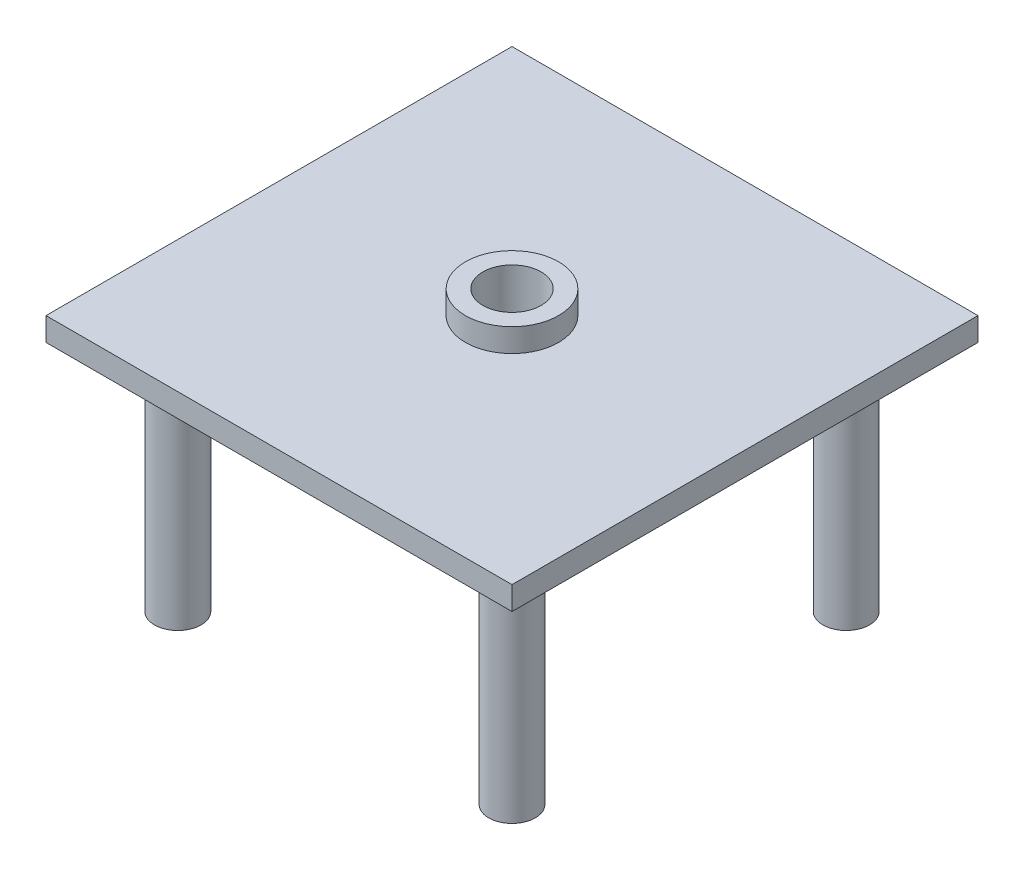
ISO-10303-21;
HEADER;
FILE_DESCRIPTION(('STEP AP214'),'2;1');
FILE_NAME('part.step','',(''),(''),'','','');
FILE_SCHEMA(('AUTOMOTIVE_DESIGN { 1 0 10303 214 1 1 1 1 }'));
ENDSEC;
DATA;
#1=APPLICATION_CONTEXT('core data for automotive mechanical design processes');
#2=APPLICATION_PROTOCOL_DEFINITION('international standard','automotive_design',2000,#1);
#3=PRODUCT_CONTEXT('',#1,'mechanical');
#4=PRODUCT('Part','Part','',(#3));
#5=PRODUCT_RELATED_PRODUCT_CATEGORY('part','',(#4));
#6=PRODUCT_DEFINITION_FORMATION('','',#4);
#7=PRODUCT_DEFINITION_CONTEXT('part definition',#1,'design');
#8=PRODUCT_DEFINITION('design','',#6,#7);
#9=PRODUCT_DEFINITION_SHAPE('','',#8);
#10=(LENGTH_UNIT() NAMED_UNIT(*) SI_UNIT(.MILLI.,.METRE.));
#11=(NAMED_UNIT(*) PLANE_ANGLE_UNIT() SI_UNIT($,.RADIAN.));
#12=(NAMED_UNIT(*) SI_UNIT($,.STERADIAN.) SOLID_ANGLE_UNIT());
#13=UNCERTAINTY_MEASURE_WITH_UNIT(LENGTH_MEASURE(1.E-05),#10,'distance_accuracy_value','');
#14=(GEOMETRIC_REPRESENTATION_CONTEXT(3) GLOBAL_UNCERTAINTY_ASSIGNED_CONTEXT((#13)) GLOBAL_UNIT_ASSIGNED_CONTEXT((#10,
#11,#12)) REPRESENTATION_CONTEXT('',''));
#15=CARTESIAN_POINT('',(0.,0.,0.));
#16=DIRECTION('',(0.,0.,1.));
#17=DIRECTION('',(1.,0.,0.));
#18=AXIS2_PLACEMENT_3D('',#15,#16,#17);
#19=CARTESIAN_POINT('',(0.,220.,0.));
#20=DIRECTION('',(0.,1.,0.));
#21=DIRECTION('',(0.,0.,1.));
#22=AXIS2_PLACEMENT_3D('',#19,#20,#21);
#23=PLANE('',#22);
#24=DIRECTION('',(0.,0.,-1.));
#25=VECTOR('',#24,1.);
#26=CARTESIAN_POINT('',(200.,220.,-200.));
#27=LINE('',#26,#25);
#28=CARTESIAN_POINT('',(200.,220.,200.));
#29=VERTEX_POINT('',#28);
#30=CARTESIAN_POINT('',(200.,220.,-200.));
#31=VERTEX_POINT('',#30);
#32=EDGE_CURVE('E86',#29,#31,#27,.T.);
#33=ORIENTED_EDGE('',*,*,#32,.T.);
#34=DIRECTION('',(-1.,0.,0.));
#35=VECTOR('',#34,1.);
#36=CARTESIAN_POINT('',(-200.,220.,-200.));
#37=LINE('',#36,#35);
#38=CARTESIAN_POINT('',(-200.,220.,-200.));
#39=VERTEX_POINT('',#38);
#40=EDGE_CURVE('E81',#31,#39,#37,.T.);
#41=ORIENTED_EDGE('',*,*,#40,.T.);
#42=DIRECTION('',(0.,0.,1.));
#43=VECTOR('',#42,1.);
#44=CARTESIAN_POINT('',(-200.,220.,-200.));
#45=LINE('',#44,#43);
#46=CARTESIAN_POINT('',(-200.,220.,200.));
#47=VERTEX_POINT('',#46);
#48=EDGE_CURVE('E84',#39,#47,#45,.T.);
#49=ORIENTED_EDGE('',*,*,#48,.T.);
#50=DIRECTION('',(1.,0.,0.));
#51=VECTOR('',#50,1.);
#52=CARTESIAN_POINT('',(-200.,220.,200.));
#53=LINE('',#52,#51);
#54=EDGE_CURVE('E50',#47,#29,#53,.T.);
#55=ORIENTED_EDGE('',*,*,#54,.T.);
#56=EDGE_LOOP('',(#33,#41,#49,#55));
#57=FACE_BOUND('',#56,.T.);
#58=CARTESIAN_POINT('',(0.,220.,0.));
#59=DIRECTION('',(0.,1.,0.));
#60=DIRECTION('',(0.,0.,1.));
#61=AXIS2_PLACEMENT_3D('',#58,#59,#60);
#62=CIRCLE('',#61,40.);
#63=CARTESIAN_POINT('',(0.,220.,40.0000000000001));
#64=VERTEX_POINT('',#63);
#65=EDGE_CURVE('E153',#64,#64,#62,.T.);
#66=ORIENTED_EDGE('',*,*,#65,.F.);
#67=EDGE_LOOP('',(#66));
#68=FACE_BOUND('',#67,.T.);
#69=ADVANCED_FACE('F33',(#57,#68),#23,.T.);
#70=CARTESIAN_POINT('',(-143.431457505076,200.,-143.431457505076));
#71=DIRECTION('',(0.,-1.,0.));
#72=DIRECTION('',(0.,0.,-1.));
#73=AXIS2_PLACEMENT_3D('',#70,#71,#72);
#74=CYLINDRICAL_SURFACE('',#73,20.);
#75=CARTESIAN_POINT('',(-143.431457505076,200.,-143.431457505076));
#76=DIRECTION('',(0.,1.,0.));
#77=DIRECTION('',(0.,0.,1.));
#78=AXIS2_PLACEMENT_3D('',#75,#76,#77);
#79=CIRCLE('',#78,20.);
#80=CARTESIAN_POINT('',(-143.431457505076,200.,-123.431457505076));
#81=VERTEX_POINT('',#80);
#82=EDGE_CURVE('E112',#81,#81,#79,.T.);
#83=ORIENTED_EDGE('',*,*,#82,.F.);
#84=EDGE_LOOP('',(#83));
#85=FACE_BOUND('',#84,.T.);
#86=CARTESIAN_POINT('',(-143.431457505076,0.,-143.431457505076));
#87=DIRECTION('',(0.,1.,0.));
#88=DIRECTION('',(0.,0.,1.));
#89=AXIS2_PLACEMENT_3D('',#86,#87,#88);
#90=CIRCLE('',#89,20.);
#91=CARTESIAN_POINT('',(-143.431457505076,0.,-123.431457505076));
#92=VERTEX_POINT('',#91);
#93=EDGE_CURVE('E111',#92,#92,#90,.T.);
#94=ORIENTED_EDGE('',*,*,#93,.T.);
#95=EDGE_LOOP('',(#94));
#96=FACE_BOUND('',#95,.T.);
#97=ADVANCED_FACE('F35',(#85,#96),#74,.T.);
#98=CARTESIAN_POINT('',(-143.431457505076,0.,-143.431457505076));
#99=DIRECTION('',(0.,1.,0.));
#100=DIRECTION('',(0.,0.,1.));
#101=AXIS2_PLACEMENT_3D('',#98,#99,#100);
#102=PLANE('',#101);
#103=ORIENTED_EDGE('',*,*,#93,.F.);
#104=EDGE_LOOP('',(#103));
#105=FACE_BOUND('',#104,.T.);
#106=ADVANCED_FACE('F129',(#105),#102,.F.);
#107=CARTESIAN_POINT('',(0.,200.,0.));
#108=DIRECTION('',(0.,1.,0.));
#109=DIRECTION('',(0.,0.,1.));
#110=AXIS2_PLACEMENT_3D('',#107,#108,#109);
#111=PLANE('',#110);
#112=CARTESIAN_POINT('',(143.431457505076,200.,-143.431457505088));
#113=DIRECTION('',(0.,1.,0.));
#114=DIRECTION('',(0.,0.,1.));
#115=AXIS2_PLACEMENT_3D('',#112,#113,#114);
#116=CIRCLE('',#115,20.);
#117=CARTESIAN_POINT('',(143.431457505076,200.,-123.431457505088));
#118=VERTEX_POINT('',#117);
#119=EDGE_CURVE('E11',#118,#118,#116,.F.);
#120=ORIENTED_EDGE('',*,*,#119,.F.);
#121=EDGE_LOOP('',(#120));
#122=FACE_BOUND('',#121,.T.);
#123=CARTESIAN_POINT('',(143.431457505088,200.,143.431457505064));
#124=DIRECTION('',(0.,1.,0.));
#125=DIRECTION('',(0.,0.,1.));
#126=AXIS2_PLACEMENT_3D('',#123,#124,#125);
#127=CIRCLE('',#126,20.);
#128=CARTESIAN_POINT('',(143.431457505088,200.,163.431457505064));
#129=VERTEX_POINT('',#128);
#130=EDGE_CURVE('E42',#129,#129,#127,.F.);
#131=ORIENTED_EDGE('',*,*,#130,.F.);
#132=EDGE_LOOP('',(#131));
#133=FACE_BOUND('',#132,.T.);
#134=CARTESIAN_POINT('',(-143.431457505064,200.,143.431457505076));
#135=DIRECTION('',(0.,1.,0.));
#136=DIRECTION('',(0.,0.,1.));
#137=AXIS2_PLACEMENT_3D('',#134,#135,#136);
#138=CIRCLE('',#137,20.);
#139=CARTESIAN_POINT('',(-143.431457505064,200.,163.431457505076));
#140=VERTEX_POINT('',#139);
#141=EDGE_CURVE('E115',#140,#140,#138,.F.);
#142=ORIENTED_EDGE('',*,*,#141,.F.);
#143=EDGE_LOOP('',(#142));
#144=FACE_BOUND('',#143,.T.);
#145=ORIENTED_EDGE('',*,*,#82,.T.);
#146=EDGE_LOOP('',(#145));
#147=FACE_BOUND('',#146,.T.);
#148=DIRECTION('',(0.,0.,-1.));
#149=VECTOR('',#148,1.);
#150=CARTESIAN_POINT('',(200.,200.,-200.));
#151=LINE('',#150,#149);
#152=CARTESIAN_POINT('',(200.,200.,200.));
#153=VERTEX_POINT('',#152);
#154=CARTESIAN_POINT('',(200.,200.,-200.));
#155=VERTEX_POINT('',#154);
#156=EDGE_CURVE('E101',#153,#155,#151,.T.);
#157=ORIENTED_EDGE('',*,*,#156,.F.);
#158=DIRECTION('',(1.,0.,0.));
#159=VECTOR('',#158,1.);
#160=CARTESIAN_POINT('',(-200.,200.,200.));
#161=LINE('',#160,#159);
#162=CARTESIAN_POINT('',(-200.,200.,200.));
#163=VERTEX_POINT('',#162);
#164=EDGE_CURVE('E73',#163,#153,#161,.T.);
#165=ORIENTED_EDGE('',*,*,#164,.F.);
#166=DIRECTION('',(0.,0.,1.));
#167=VECTOR('',#166,1.);
#168=CARTESIAN_POINT('',(-200.,200.,-200.));
#169=LINE('',#168,#167);
#170=CARTESIAN_POINT('',(-200.,200.,-200.));
#171=VERTEX_POINT('',#170);
#172=EDGE_CURVE('E67',#171,#163,#169,.T.);
#173=ORIENTED_EDGE('',*,*,#172,.F.);
#174=DIRECTION('',(-1.,0.,0.));
#175=VECTOR('',#174,1.);
#176=CARTESIAN_POINT('',(-200.,200.,-200.));
#177=LINE('',#176,#175);
#178=EDGE_CURVE('E91',#155,#171,#177,.T.);
#179=ORIENTED_EDGE('',*,*,#178,.F.);
#180=EDGE_LOOP('',(#157,#165,#173,#179));
#181=FACE_BOUND('',#180,.T.);
#182=CARTESIAN_POINT('',(0.,200.,0.));
#183=DIRECTION('',(0.,1.,0.));
#184=DIRECTION('',(0.,0.,1.));
#185=AXIS2_PLACEMENT_3D('',#182,#183,#184);
#186=CIRCLE('',#185,25.);
#187=CARTESIAN_POINT('',(0.,200.,25.0000000000001));
#188=VERTEX_POINT('',#187);
#189=EDGE_CURVE('E104',#188,#188,#186,.T.);
#190=ORIENTED_EDGE('',*,*,#189,.T.);
#191=EDGE_LOOP('',(#190));
#192=FACE_BOUND('',#191,.T.);
#193=ADVANCED_FACE('F125',(#122,#133,#144,#147,#181,#192),#111,.F.);
#194=CARTESIAN_POINT('',(200.,220.,-200.));
#195=DIRECTION('',(-1.,0.,0.));
#196=DIRECTION('',(0.,0.,1.));
#197=AXIS2_PLACEMENT_3D('',#194,#195,#196);
#198=PLANE('',#197);
#199=ORIENTED_EDGE('',*,*,#156,.T.);
#200=DIRECTION('',(0.,-1.,0.));
#201=VECTOR('',#200,1.);
#202=CARTESIAN_POINT('',(200.,220.,-200.));
#203=LINE('',#202,#201);
#204=EDGE_CURVE('E92',#31,#155,#203,.T.);
#205=ORIENTED_EDGE('',*,*,#204,.F.);
#206=ORIENTED_EDGE('',*,*,#32,.F.);
#207=DIRECTION('',(0.,-1.,0.));
#208=VECTOR('',#207,1.);
#209=CARTESIAN_POINT('',(200.,220.,200.));
#210=LINE('',#209,#208);
#211=EDGE_CURVE('E97',#29,#153,#210,.T.);
#212=ORIENTED_EDGE('',*,*,#211,.T.);
#213=EDGE_LOOP('',(#199,#205,#206,#212));
#214=FACE_BOUND('',#213,.T.);
#215=ADVANCED_FACE('F128',(#214),#198,.F.);
#216=CARTESIAN_POINT('',(-200.,220.,-200.));
#217=DIRECTION('',(0.,0.,1.));
#218=DIRECTION('',(1.,0.,0.));
#219=AXIS2_PLACEMENT_3D('',#216,#217,#218);
#220=PLANE('',#219);
#221=ORIENTED_EDGE('',*,*,#178,.T.);
#222=DIRECTION('',(0.,-1.,0.));
#223=VECTOR('',#222,1.);
#224=CARTESIAN_POINT('',(-200.,220.,-200.));
#225=LINE('',#224,#223);
#226=EDGE_CURVE('E89',#39,#171,#225,.T.);
#227=ORIENTED_EDGE('',*,*,#226,.F.);
#228=ORIENTED_EDGE('',*,*,#40,.F.);
#229=ORIENTED_EDGE('',*,*,#204,.T.);
#230=EDGE_LOOP('',(#221,#227,#228,#229));
#231=FACE_BOUND('',#230,.T.);
#232=ADVANCED_FACE('F90',(#231),#220,.F.);
#233=CARTESIAN_POINT('',(-200.,220.,-200.));
#234=DIRECTION('',(1.,0.,0.));
#235=DIRECTION('',(0.,0.,-1.));
#236=AXIS2_PLACEMENT_3D('',#233,#234,#235);
#237=PLANE('',#236);
#238=ORIENTED_EDGE('',*,*,#172,.T.);
#239=DIRECTION('',(0.,-1.,0.));
#240=VECTOR('',#239,1.);
#241=CARTESIAN_POINT('',(-200.,220.,200.));
#242=LINE('',#241,#240);
#243=EDGE_CURVE('E93',#47,#163,#242,.T.);
#244=ORIENTED_EDGE('',*,*,#243,.F.);
#245=ORIENTED_EDGE('',*,*,#48,.F.);
#246=ORIENTED_EDGE('',*,*,#226,.T.);
#247=EDGE_LOOP('',(#238,#244,#245,#246));
#248=FACE_BOUND('',#247,.T.);
#249=ADVANCED_FACE('F95',(#248),#237,.F.);
#250=CARTESIAN_POINT('',(-200.,220.,200.));
#251=DIRECTION('',(0.,0.,-1.));
#252=DIRECTION('',(-1.,0.,0.));
#253=AXIS2_PLACEMENT_3D('',#250,#251,#252);
#254=PLANE('',#253);
#255=ORIENTED_EDGE('',*,*,#164,.T.);
#256=ORIENTED_EDGE('',*,*,#211,.F.);
#257=ORIENTED_EDGE('',*,*,#54,.F.);
#258=ORIENTED_EDGE('',*,*,#243,.T.);
#259=EDGE_LOOP('',(#255,#256,#257,#258));
#260=FACE_BOUND('',#259,.T.);
#261=ADVANCED_FACE('F188',(#260),#254,.F.);
#262=CARTESIAN_POINT('',(0.,220.,0.));
#263=DIRECTION('',(0.,-1.,0.));
#264=DIRECTION('',(0.,0.,-1.));
#265=AXIS2_PLACEMENT_3D('',#262,#263,#264);
#266=CYLINDRICAL_SURFACE('',#265,25.);
#267=ORIENTED_EDGE('',*,*,#189,.F.);
#268=EDGE_LOOP('',(#267));
#269=FACE_BOUND('',#268,.T.);
#270=CARTESIAN_POINT('',(0.,240.,0.));
#271=DIRECTION('',(0.,1.,0.));
#272=DIRECTION('',(0.,0.,1.));
#273=AXIS2_PLACEMENT_3D('',#270,#271,#272);
#274=CIRCLE('',#273,25.);
#275=CARTESIAN_POINT('',(0.,240.,25.0000000000001));
#276=VERTEX_POINT('',#275);
#277=EDGE_CURVE('E156',#276,#276,#274,.T.);
#278=ORIENTED_EDGE('',*,*,#277,.T.);
#279=EDGE_LOOP('',(#278));
#280=FACE_BOUND('',#279,.T.);
#281=ADVANCED_FACE('F162',(#269,#280),#266,.F.);
#282=CARTESIAN_POINT('',(-143.431457505064,200.,143.431457505076));
#283=DIRECTION('',(0.,-1.,0.));
#284=DIRECTION('',(0.,0.,-1.));
#285=AXIS2_PLACEMENT_3D('',#282,#283,#284);
#286=CYLINDRICAL_SURFACE('',#285,20.);
#287=ORIENTED_EDGE('',*,*,#141,.T.);
#288=EDGE_LOOP('',(#287));
#289=FACE_BOUND('',#288,.T.);
#290=CARTESIAN_POINT('',(-143.431457505064,0.,143.431457505076));
#291=DIRECTION('',(0.,1.,0.));
#292=DIRECTION('',(0.,0.,1.));
#293=AXIS2_PLACEMENT_3D('',#290,#291,#292);
#294=CIRCLE('',#293,20.);
#295=CARTESIAN_POINT('',(-143.431457505064,0.,163.431457505076));
#296=VERTEX_POINT('',#295);
#297=EDGE_CURVE('E141',#296,#296,#294,.T.);
#298=ORIENTED_EDGE('',*,*,#297,.T.);
#299=EDGE_LOOP('',(#298));
#300=FACE_BOUND('',#299,.T.);
#301=ADVANCED_FACE('F232',(#289,#300),#286,.T.);
#302=CARTESIAN_POINT('',(-143.431457505064,0.,143.431457505076));
#303=DIRECTION('',(0.,1.,0.));
#304=DIRECTION('',(0.,0.,1.));
#305=AXIS2_PLACEMENT_3D('',#302,#303,#304);
#306=PLANE('',#305);
#307=ORIENTED_EDGE('',*,*,#297,.F.);
#308=EDGE_LOOP('',(#307));
#309=FACE_BOUND('',#308,.T.);
#310=ADVANCED_FACE('F237',(#309),#306,.F.);
#311=CARTESIAN_POINT('',(143.431457505088,200.,143.431457505064));
#312=DIRECTION('',(0.,-1.,0.));
#313=DIRECTION('',(0.,0.,-1.));
#314=AXIS2_PLACEMENT_3D('',#311,#312,#313);
#315=CYLINDRICAL_SURFACE('',#314,20.);
#316=ORIENTED_EDGE('',*,*,#130,.T.);
#317=EDGE_LOOP('',(#316));
#318=FACE_BOUND('',#317,.T.);
#319=CARTESIAN_POINT('',(143.431457505088,0.,143.431457505064));
#320=DIRECTION('',(0.,1.,0.));
#321=DIRECTION('',(0.,0.,1.));
#322=AXIS2_PLACEMENT_3D('',#319,#320,#321);
#323=CIRCLE('',#322,20.);
#324=CARTESIAN_POINT('',(143.431457505088,0.,163.431457505064));
#325=VERTEX_POINT('',#324);
#326=EDGE_CURVE('E144',#325,#325,#323,.T.);
#327=ORIENTED_EDGE('',*,*,#326,.T.);
#328=EDGE_LOOP('',(#327));
#329=FACE_BOUND('',#328,.T.);
#330=ADVANCED_FACE('F122',(#318,#329),#315,.T.);
#331=CARTESIAN_POINT('',(143.431457505088,0.,143.431457505064));
#332=DIRECTION('',(0.,1.,0.));
#333=DIRECTION('',(0.,0.,1.));
#334=AXIS2_PLACEMENT_3D('',#331,#332,#333);
#335=PLANE('',#334);
#336=ORIENTED_EDGE('',*,*,#326,.F.);
#337=EDGE_LOOP('',(#336));
#338=FACE_BOUND('',#337,.T.);
#339=ADVANCED_FACE('F251',(#338),#335,.F.);
#340=CARTESIAN_POINT('',(143.431457505076,200.,-143.431457505088));
#341=DIRECTION('',(0.,-1.,0.));
#342=DIRECTION('',(0.,0.,-1.));
#343=AXIS2_PLACEMENT_3D('',#340,#341,#342);
#344=CYLINDRICAL_SURFACE('',#343,20.);
#345=ORIENTED_EDGE('',*,*,#119,.T.);
#346=EDGE_LOOP('',(#345));
#347=FACE_BOUND('',#346,.T.);
#348=CARTESIAN_POINT('',(143.431457505076,0.,-143.431457505088));
#349=DIRECTION('',(0.,1.,0.));
#350=DIRECTION('',(0.,0.,1.));
#351=AXIS2_PLACEMENT_3D('',#348,#349,#350);
#352=CIRCLE('',#351,20.);
#353=CARTESIAN_POINT('',(143.431457505076,0.,-123.431457505088));
#354=VERTEX_POINT('',#353);
#355=EDGE_CURVE('E149',#354,#354,#352,.T.);
#356=ORIENTED_EDGE('',*,*,#355,.T.);
#357=EDGE_LOOP('',(#356));
#358=FACE_BOUND('',#357,.T.);
#359=ADVANCED_FACE('F176',(#347,#358),#344,.T.);
#360=CARTESIAN_POINT('',(143.431457505076,0.,-143.431457505088));
#361=DIRECTION('',(0.,1.,0.));
#362=DIRECTION('',(0.,0.,1.));
#363=AXIS2_PLACEMENT_3D('',#360,#361,#362);
#364=PLANE('',#363);
#365=ORIENTED_EDGE('',*,*,#355,.F.);
#366=EDGE_LOOP('',(#365));
#367=FACE_BOUND('',#366,.T.);
#368=ADVANCED_FACE('F167',(#367),#364,.F.);
#369=CARTESIAN_POINT('',(0.,240.,0.));
#370=DIRECTION('',(0.,1.,0.));
#371=DIRECTION('',(0.,0.,1.));
#372=AXIS2_PLACEMENT_3D('',#369,#370,#371);
#373=PLANE('',#372);
#374=CARTESIAN_POINT('',(0.,240.,0.));
#375=DIRECTION('',(0.,1.,0.));
#376=DIRECTION('',(0.,0.,1.));
#377=AXIS2_PLACEMENT_3D('',#374,#375,#376);
#378=CIRCLE('',#377,40.);
#379=CARTESIAN_POINT('',(0.,240.,40.0000000000001));
#380=VERTEX_POINT('',#379);
#381=EDGE_CURVE('E152',#380,#380,#378,.T.);
#382=ORIENTED_EDGE('',*,*,#381,.T.);
#383=EDGE_LOOP('',(#382));
#384=FACE_BOUND('',#383,.T.);
#385=ORIENTED_EDGE('',*,*,#277,.F.);
#386=EDGE_LOOP('',(#385));
#387=FACE_BOUND('',#386,.T.);
#388=ADVANCED_FACE('F164',(#384,#387),#373,.T.);
#389=CARTESIAN_POINT('',(0.,240.,0.));
#390=DIRECTION('',(0.,-1.,0.));
#391=DIRECTION('',(0.,0.,-1.));
#392=AXIS2_PLACEMENT_3D('',#389,#390,#391);
#393=CYLINDRICAL_SURFACE('',#392,40.);
#394=ORIENTED_EDGE('',*,*,#381,.F.);
#395=EDGE_LOOP('',(#394));
#396=FACE_BOUND('',#395,.T.);
#397=ORIENTED_EDGE('',*,*,#65,.T.);
#398=EDGE_LOOP('',(#397));
#399=FACE_BOUND('',#398,.T.);
#400=ADVANCED_FACE('F166',(#396,#399),#393,.T.);
#401=CLOSED_SHELL('',(#69,#97,#106,#193,#215,#232,#249,#261,#281,#301,#310,#330,#339,#359,#368,
#388,#400));
#402=MANIFOLD_SOLID_BREP('B2',#401);
#403=ADVANCED_BREP_SHAPE_REPRESENTATION('',(#18,#402),#14);
#404=SHAPE_DEFINITION_REPRESENTATION(#9,#403);
ENDSEC;
END-ISO-10303-21;
